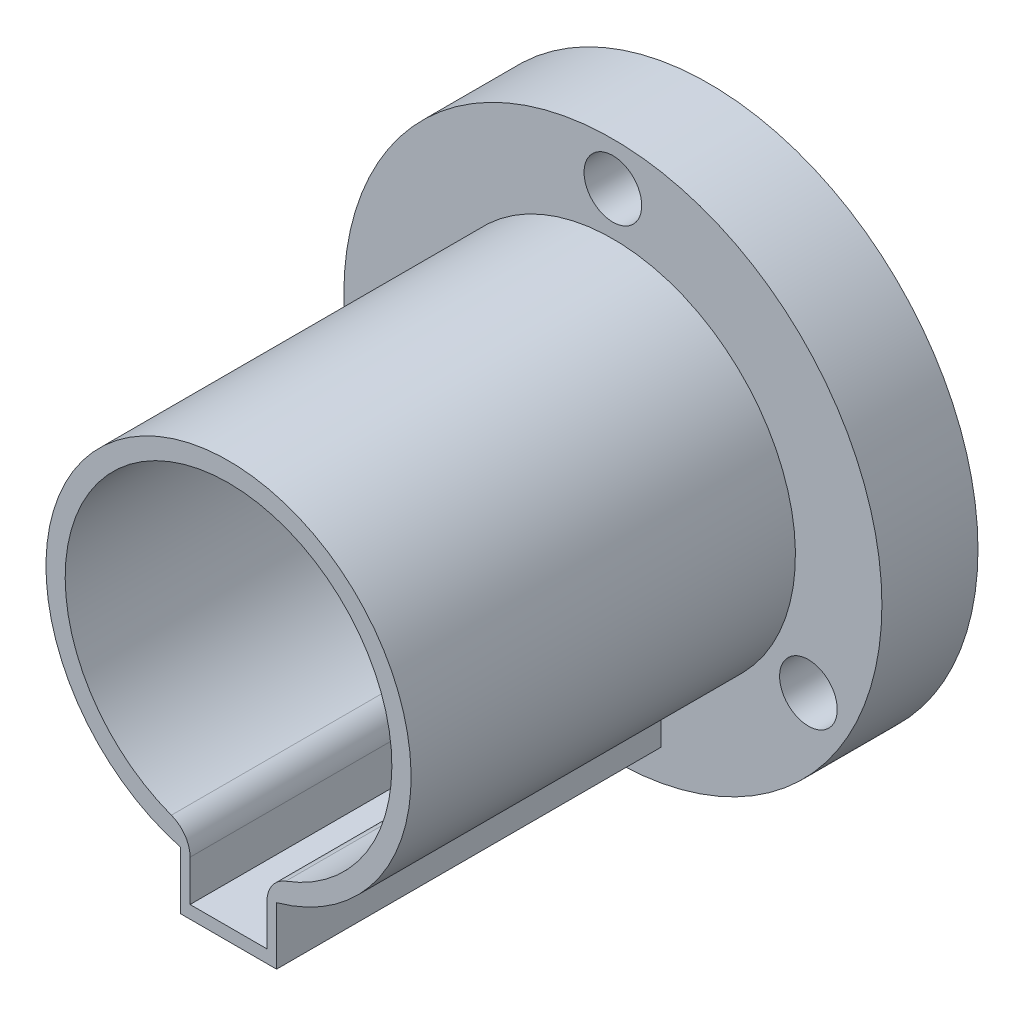
ISO-10303-21;
HEADER;
FILE_DESCRIPTION(('STEP AP214'),'2;1');
FILE_NAME('part.step','',(''),(''),'','','');
FILE_SCHEMA(('AUTOMOTIVE_DESIGN { 1 0 10303 214 1 1 1 1 }'));
ENDSEC;
DATA;
#1=APPLICATION_CONTEXT('core data for automotive mechanical design processes');
#2=APPLICATION_PROTOCOL_DEFINITION('international standard','automotive_design',2000,#1);
#3=PRODUCT_CONTEXT('',#1,'mechanical');
#4=PRODUCT('Part','Part','',(#3));
#5=PRODUCT_RELATED_PRODUCT_CATEGORY('part','',(#4));
#6=PRODUCT_DEFINITION_FORMATION('','',#4);
#7=PRODUCT_DEFINITION_CONTEXT('part definition',#1,'design');
#8=PRODUCT_DEFINITION('design','',#6,#7);
#9=PRODUCT_DEFINITION_SHAPE('','',#8);
#10=(LENGTH_UNIT() NAMED_UNIT(*) SI_UNIT(.MILLI.,.METRE.));
#11=(NAMED_UNIT(*) PLANE_ANGLE_UNIT() SI_UNIT($,.RADIAN.));
#12=(NAMED_UNIT(*) SI_UNIT($,.STERADIAN.) SOLID_ANGLE_UNIT());
#13=UNCERTAINTY_MEASURE_WITH_UNIT(LENGTH_MEASURE(1.E-05),#10,'distance_accuracy_value','');
#14=(GEOMETRIC_REPRESENTATION_CONTEXT(3) GLOBAL_UNCERTAINTY_ASSIGNED_CONTEXT((#13)) GLOBAL_UNIT_ASSIGNED_CONTEXT((#10,
#11,#12)) REPRESENTATION_CONTEXT('',''));
#15=CARTESIAN_POINT('',(0.,0.,0.));
#16=DIRECTION('',(0.,0.,1.));
#17=DIRECTION('',(1.,0.,0.));
#18=AXIS2_PLACEMENT_3D('',#15,#16,#17);
#19=CARTESIAN_POINT('',(0.,0.,5.));
#20=DIRECTION('',(0.,0.,1.));
#21=DIRECTION('',(1.,0.,0.));
#22=AXIS2_PLACEMENT_3D('',#19,#20,#21);
#23=PLANE('',#22);
#24=CARTESIAN_POINT('',(10.1757984944672,-5.87499999999991,5.));
#25=DIRECTION('',(0.,0.,1.));
#26=DIRECTION('',(-0.499999999999992,-0.866025403784443,0.));
#27=AXIS2_PLACEMENT_3D('',#24,#25,#26);
#28=CIRCLE('',#27,1.5);
#29=CARTESIAN_POINT('',(9.42579849446722,-7.17403810567657,5.));
#30=VERTEX_POINT('',#29);
#31=EDGE_CURVE('E258',#30,#30,#28,.T.);
#32=ORIENTED_EDGE('',*,*,#31,.F.);
#33=EDGE_LOOP('',(#32));
#34=FACE_BOUND('',#33,.T.);
#35=CARTESIAN_POINT('',(-10.1757984944671,-5.87500000000005,5.));
#36=DIRECTION('',(0.,0.,1.));
#37=DIRECTION('',(-0.500000000000004,0.866025403784436,0.));
#38=AXIS2_PLACEMENT_3D('',#35,#36,#37);
#39=CIRCLE('',#38,1.5);
#40=CARTESIAN_POINT('',(-10.9257984944671,-4.57596189432339,5.));
#41=VERTEX_POINT('',#40);
#42=EDGE_CURVE('E254',#41,#41,#39,.T.);
#43=ORIENTED_EDGE('',*,*,#42,.F.);
#44=EDGE_LOOP('',(#43));
#45=FACE_BOUND('',#44,.T.);
#46=CARTESIAN_POINT('',(0.,11.75,5.));
#47=DIRECTION('',(0.,0.,1.));
#48=DIRECTION('',(1.,0.,0.));
#49=AXIS2_PLACEMENT_3D('',#46,#47,#48);
#50=CIRCLE('',#49,1.5);
#51=CARTESIAN_POINT('',(1.5,11.75,5.));
#52=VERTEX_POINT('',#51);
#53=EDGE_CURVE('E250',#52,#52,#50,.T.);
#54=ORIENTED_EDGE('',*,*,#53,.F.);
#55=EDGE_LOOP('',(#54));
#56=FACE_BOUND('',#55,.T.);
#57=CARTESIAN_POINT('',(0.,0.,5.));
#58=DIRECTION('',(0.,0.,1.));
#59=DIRECTION('',(1.,0.,0.));
#60=AXIS2_PLACEMENT_3D('',#57,#58,#59);
#61=CIRCLE('',#60,14.);
#62=CARTESIAN_POINT('',(14.,0.,5.));
#63=VERTEX_POINT('',#62);
#64=EDGE_CURVE('E176',#63,#63,#61,.T.);
#65=ORIENTED_EDGE('',*,*,#64,.T.);
#66=EDGE_LOOP('',(#65));
#67=FACE_BOUND('',#66,.T.);
#68=DIRECTION('',(0.,-1.,0.));
#69=VECTOR('',#68,1.);
#70=CARTESIAN_POINT('',(-2.5,-9.16515138991168,5.));
#71=LINE('',#70,#69);
#72=CARTESIAN_POINT('',(-2.5,-9.16515138991168,5.));
#73=VERTEX_POINT('',#72);
#74=CARTESIAN_POINT('',(-2.5,-12.1651513899117,5.));
#75=VERTEX_POINT('',#74);
#76=EDGE_CURVE('E160',#73,#75,#71,.T.);
#77=ORIENTED_EDGE('',*,*,#76,.F.);
#78=CARTESIAN_POINT('',(0.,0.,5.));
#79=DIRECTION('',(0.,0.,1.));
#80=DIRECTION('',(1.,0.,0.));
#81=AXIS2_PLACEMENT_3D('',#78,#79,#80);
#82=CIRCLE('',#81,9.5);
#83=CARTESIAN_POINT('',(2.5,-9.16515138991168,5.));
#84=VERTEX_POINT('',#83);
#85=EDGE_CURVE('E144',#84,#73,#82,.T.);
#86=ORIENTED_EDGE('',*,*,#85,.F.);
#87=DIRECTION('',(0.,1.,0.));
#88=VECTOR('',#87,1.);
#89=CARTESIAN_POINT('',(2.5,-9.16515138991168,5.));
#90=LINE('',#89,#88);
#91=CARTESIAN_POINT('',(2.5,-12.1651513899117,5.));
#92=VERTEX_POINT('',#91);
#93=EDGE_CURVE('E151',#92,#84,#90,.T.);
#94=ORIENTED_EDGE('',*,*,#93,.F.);
#95=DIRECTION('',(1.,0.,0.));
#96=VECTOR('',#95,1.);
#97=CARTESIAN_POINT('',(2.5,-12.1651513899117,5.));
#98=LINE('',#97,#96);
#99=EDGE_CURVE('E162',#75,#92,#98,.T.);
#100=ORIENTED_EDGE('',*,*,#99,.F.);
#101=EDGE_LOOP('',(#77,#86,#94,#100));
#102=FACE_BOUND('',#101,.T.);
#103=ADVANCED_FACE('F33',(#34,#45,#56,#67,#102),#23,.T.);
#104=CARTESIAN_POINT('',(0.,0.,5.));
#105=DIRECTION('',(0.,0.,-1.));
#106=DIRECTION('',(-1.,0.,0.));
#107=AXIS2_PLACEMENT_3D('',#104,#105,#106);
#108=CYLINDRICAL_SURFACE('',#107,14.);
#109=ORIENTED_EDGE('',*,*,#64,.F.);
#110=EDGE_LOOP('',(#109));
#111=FACE_BOUND('',#110,.T.);
#112=CARTESIAN_POINT('',(0.,0.,0.));
#113=DIRECTION('',(0.,0.,1.));
#114=DIRECTION('',(1.,0.,0.));
#115=AXIS2_PLACEMENT_3D('',#112,#113,#114);
#116=CIRCLE('',#115,14.);
#117=CARTESIAN_POINT('',(14.,0.,0.));
#118=VERTEX_POINT('',#117);
#119=EDGE_CURVE('E175',#118,#118,#116,.T.);
#120=ORIENTED_EDGE('',*,*,#119,.T.);
#121=EDGE_LOOP('',(#120));
#122=FACE_BOUND('',#121,.T.);
#123=ADVANCED_FACE('F214',(#111,#122),#108,.T.);
#124=CARTESIAN_POINT('',(0.,0.,0.));
#125=DIRECTION('',(0.,0.,1.));
#126=DIRECTION('',(1.,0.,0.));
#127=AXIS2_PLACEMENT_3D('',#124,#125,#126);
#128=PLANE('',#127);
#129=CARTESIAN_POINT('',(10.1757984944672,-5.87499999999991,0.));
#130=DIRECTION('',(0.,0.,1.));
#131=DIRECTION('',(-0.499999999999992,-0.866025403784443,0.));
#132=AXIS2_PLACEMENT_3D('',#129,#130,#131);
#133=CIRCLE('',#132,1.5);
#134=CARTESIAN_POINT('',(9.42579849446722,-7.17403810567657,0.));
#135=VERTEX_POINT('',#134);
#136=EDGE_CURVE('E242',#135,#135,#133,.T.);
#137=ORIENTED_EDGE('',*,*,#136,.T.);
#138=EDGE_LOOP('',(#137));
#139=FACE_BOUND('',#138,.T.);
#140=CARTESIAN_POINT('',(-10.1757984944671,-5.87500000000005,0.));
#141=DIRECTION('',(0.,0.,1.));
#142=DIRECTION('',(-0.500000000000004,0.866025403784436,0.));
#143=AXIS2_PLACEMENT_3D('',#140,#141,#142);
#144=CIRCLE('',#143,1.5);
#145=CARTESIAN_POINT('',(-10.9257984944671,-4.57596189432339,0.));
#146=VERTEX_POINT('',#145);
#147=EDGE_CURVE('E246',#146,#146,#144,.T.);
#148=ORIENTED_EDGE('',*,*,#147,.T.);
#149=EDGE_LOOP('',(#148));
#150=FACE_BOUND('',#149,.T.);
#151=CARTESIAN_POINT('',(0.,11.75,0.));
#152=DIRECTION('',(0.,0.,1.));
#153=DIRECTION('',(1.,0.,0.));
#154=AXIS2_PLACEMENT_3D('',#151,#152,#153);
#155=CIRCLE('',#154,1.5);
#156=CARTESIAN_POINT('',(1.5,11.75,0.));
#157=VERTEX_POINT('',#156);
#158=EDGE_CURVE('E137',#157,#157,#155,.T.);
#159=ORIENTED_EDGE('',*,*,#158,.T.);
#160=EDGE_LOOP('',(#159));
#161=FACE_BOUND('',#160,.T.);
#162=DIRECTION('',(0.,1.,0.));
#163=VECTOR('',#162,1.);
#164=CARTESIAN_POINT('',(2.,0.,0.));
#165=LINE('',#164,#163);
#166=CARTESIAN_POINT('',(2.,-11.5,0.));
#167=VERTEX_POINT('',#166);
#168=CARTESIAN_POINT('',(2.,-9.3674969975976,0.));
#169=VERTEX_POINT('',#168);
#170=EDGE_CURVE('E128',#167,#169,#165,.T.);
#171=ORIENTED_EDGE('',*,*,#170,.T.);
#172=CARTESIAN_POINT('',(3.5,-9.3674969975976,0.));
#173=DIRECTION('',(0.,0.,1.));
#174=DIRECTION('',(1.,0.,0.));
#175=AXIS2_PLACEMENT_3D('',#172,#173,#174);
#176=CIRCLE('',#175,1.5);
#177=CARTESIAN_POINT('',(2.975,-7.96237244795796,0.));
#178=VERTEX_POINT('',#177);
#179=EDGE_CURVE('E41',#169,#178,#176,.F.);
#180=ORIENTED_EDGE('',*,*,#179,.T.);
#181=CARTESIAN_POINT('',(0.,0.,0.));
#182=DIRECTION('',(0.,0.,1.));
#183=DIRECTION('',(1.,0.,0.));
#184=AXIS2_PLACEMENT_3D('',#181,#182,#183);
#185=CIRCLE('',#184,8.5);
#186=CARTESIAN_POINT('',(-2.975,-7.96237244795796,0.));
#187=VERTEX_POINT('',#186);
#188=EDGE_CURVE('E142',#178,#187,#185,.T.);
#189=ORIENTED_EDGE('',*,*,#188,.T.);
#190=CARTESIAN_POINT('',(-3.5,-9.3674969975976,0.));
#191=DIRECTION('',(0.,0.,1.));
#192=DIRECTION('',(1.,0.,0.));
#193=AXIS2_PLACEMENT_3D('',#190,#191,#192);
#194=CIRCLE('',#193,1.5);
#195=CARTESIAN_POINT('',(-2.,-9.3674969975976,0.));
#196=VERTEX_POINT('',#195);
#197=EDGE_CURVE('E48',#187,#196,#194,.F.);
#198=ORIENTED_EDGE('',*,*,#197,.T.);
#199=DIRECTION('',(0.,-1.,0.));
#200=VECTOR('',#199,1.);
#201=CARTESIAN_POINT('',(-2.,0.,0.));
#202=LINE('',#201,#200);
#203=CARTESIAN_POINT('',(-2.,-11.5,0.));
#204=VERTEX_POINT('',#203);
#205=EDGE_CURVE('E109',#196,#204,#202,.T.);
#206=ORIENTED_EDGE('',*,*,#205,.T.);
#207=DIRECTION('',(1.,0.,0.));
#208=VECTOR('',#207,1.);
#209=CARTESIAN_POINT('',(-2.,-11.5,0.));
#210=LINE('',#209,#208);
#211=EDGE_CURVE('E114',#204,#167,#210,.T.);
#212=ORIENTED_EDGE('',*,*,#211,.T.);
#213=EDGE_LOOP('',(#171,#180,#189,#198,#206,#212));
#214=FACE_BOUND('',#213,.T.);
#215=ORIENTED_EDGE('',*,*,#119,.F.);
#216=EDGE_LOOP('',(#215));
#217=FACE_BOUND('',#216,.T.);
#218=ADVANCED_FACE('F111',(#139,#150,#161,#214,#217),#128,.F.);
#219=CARTESIAN_POINT('',(0.,0.,25.));
#220=DIRECTION('',(0.,0.,-1.));
#221=DIRECTION('',(-1.,0.,0.));
#222=AXIS2_PLACEMENT_3D('',#219,#220,#221);
#223=CYLINDRICAL_SURFACE('',#222,9.5);
#224=ORIENTED_EDGE('',*,*,#85,.T.);
#225=DIRECTION('',(0.,0.,-1.));
#226=VECTOR('',#225,1.);
#227=CARTESIAN_POINT('',(-2.5,-9.16515138991168,25.));
#228=LINE('',#227,#226);
#229=CARTESIAN_POINT('',(-2.5,-9.16515138991168,25.));
#230=VERTEX_POINT('',#229);
#231=EDGE_CURVE('E173',#230,#73,#228,.T.);
#232=ORIENTED_EDGE('',*,*,#231,.F.);
#233=CARTESIAN_POINT('',(0.,0.,25.));
#234=DIRECTION('',(0.,0.,1.));
#235=DIRECTION('',(1.,0.,0.));
#236=AXIS2_PLACEMENT_3D('',#233,#234,#235);
#237=CIRCLE('',#236,9.5);
#238=CARTESIAN_POINT('',(2.5,-9.16515138991168,25.));
#239=VERTEX_POINT('',#238);
#240=EDGE_CURVE('E147',#239,#230,#237,.T.);
#241=ORIENTED_EDGE('',*,*,#240,.F.);
#242=DIRECTION('',(0.,0.,-1.));
#243=VECTOR('',#242,1.);
#244=CARTESIAN_POINT('',(2.5,-9.16515138991168,25.));
#245=LINE('',#244,#243);
#246=EDGE_CURVE('E157',#239,#84,#245,.T.);
#247=ORIENTED_EDGE('',*,*,#246,.T.);
#248=EDGE_LOOP('',(#224,#232,#241,#247));
#249=FACE_BOUND('',#248,.T.);
#250=ADVANCED_FACE('F228',(#249),#223,.T.);
#251=CARTESIAN_POINT('',(-2.5,-9.16515138991168,25.));
#252=DIRECTION('',(1.,0.,0.));
#253=DIRECTION('',(0.,1.,0.));
#254=AXIS2_PLACEMENT_3D('',#251,#252,#253);
#255=PLANE('',#254);
#256=ORIENTED_EDGE('',*,*,#76,.T.);
#257=DIRECTION('',(0.,0.,-1.));
#258=VECTOR('',#257,1.);
#259=CARTESIAN_POINT('',(-2.5,-12.1651513899117,25.));
#260=LINE('',#259,#258);
#261=CARTESIAN_POINT('',(-2.5,-12.1651513899117,25.));
#262=VERTEX_POINT('',#261);
#263=EDGE_CURVE('E170',#262,#75,#260,.T.);
#264=ORIENTED_EDGE('',*,*,#263,.F.);
#265=DIRECTION('',(0.,-1.,0.));
#266=VECTOR('',#265,1.);
#267=CARTESIAN_POINT('',(-2.5,-9.16515138991168,25.));
#268=LINE('',#267,#266);
#269=EDGE_CURVE('E150',#230,#262,#268,.T.);
#270=ORIENTED_EDGE('',*,*,#269,.F.);
#271=ORIENTED_EDGE('',*,*,#231,.T.);
#272=EDGE_LOOP('',(#256,#264,#270,#271));
#273=FACE_BOUND('',#272,.T.);
#274=ADVANCED_FACE('F237',(#273),#255,.F.);
#275=CARTESIAN_POINT('',(2.5,-12.1651513899117,25.));
#276=DIRECTION('',(0.,1.,0.));
#277=DIRECTION('',(-1.,0.,0.));
#278=AXIS2_PLACEMENT_3D('',#275,#276,#277);
#279=PLANE('',#278);
#280=ORIENTED_EDGE('',*,*,#99,.T.);
#281=DIRECTION('',(0.,0.,-1.));
#282=VECTOR('',#281,1.);
#283=CARTESIAN_POINT('',(2.5,-12.1651513899117,25.));
#284=LINE('',#283,#282);
#285=CARTESIAN_POINT('',(2.5,-12.1651513899117,25.));
#286=VERTEX_POINT('',#285);
#287=EDGE_CURVE('E168',#286,#92,#284,.T.);
#288=ORIENTED_EDGE('',*,*,#287,.F.);
#289=DIRECTION('',(1.,0.,0.));
#290=VECTOR('',#289,1.);
#291=CARTESIAN_POINT('',(2.5,-12.1651513899117,25.));
#292=LINE('',#291,#290);
#293=EDGE_CURVE('E153',#262,#286,#292,.T.);
#294=ORIENTED_EDGE('',*,*,#293,.F.);
#295=ORIENTED_EDGE('',*,*,#263,.T.);
#296=EDGE_LOOP('',(#280,#288,#294,#295));
#297=FACE_BOUND('',#296,.T.);
#298=ADVANCED_FACE('F286',(#297),#279,.F.);
#299=CARTESIAN_POINT('',(2.5,-9.16515138991168,25.));
#300=DIRECTION('',(-1.,0.,0.));
#301=DIRECTION('',(0.,-1.,0.));
#302=AXIS2_PLACEMENT_3D('',#299,#300,#301);
#303=PLANE('',#302);
#304=ORIENTED_EDGE('',*,*,#93,.T.);
#305=ORIENTED_EDGE('',*,*,#246,.F.);
#306=DIRECTION('',(0.,1.,0.));
#307=VECTOR('',#306,1.);
#308=CARTESIAN_POINT('',(2.5,-9.16515138991168,25.));
#309=LINE('',#308,#307);
#310=EDGE_CURVE('E155',#286,#239,#309,.T.);
#311=ORIENTED_EDGE('',*,*,#310,.F.);
#312=ORIENTED_EDGE('',*,*,#287,.T.);
#313=EDGE_LOOP('',(#304,#305,#311,#312));
#314=FACE_BOUND('',#313,.T.);
#315=ADVANCED_FACE('F283',(#314),#303,.F.);
#316=CARTESIAN_POINT('',(0.,0.,25.));
#317=DIRECTION('',(0.,0.,1.));
#318=DIRECTION('',(1.,0.,0.));
#319=AXIS2_PLACEMENT_3D('',#316,#317,#318);
#320=PLANE('',#319);
#321=CARTESIAN_POINT('',(0.,0.,25.));
#322=DIRECTION('',(0.,0.,1.));
#323=DIRECTION('',(1.,0.,0.));
#324=AXIS2_PLACEMENT_3D('',#321,#322,#323);
#325=CIRCLE('',#324,8.5);
#326=CARTESIAN_POINT('',(2.975,-7.96237244795796,25.));
#327=VERTEX_POINT('',#326);
#328=CARTESIAN_POINT('',(-2.975,-7.96237244795796,25.));
#329=VERTEX_POINT('',#328);
#330=EDGE_CURVE('E140',#327,#329,#325,.T.);
#331=ORIENTED_EDGE('',*,*,#330,.F.);
#332=CARTESIAN_POINT('',(3.5,-9.3674969975976,25.));
#333=DIRECTION('',(0.,0.,1.));
#334=DIRECTION('',(1.,0.,0.));
#335=AXIS2_PLACEMENT_3D('',#332,#333,#334);
#336=CIRCLE('',#335,1.5);
#337=CARTESIAN_POINT('',(2.,-9.3674969975976,25.));
#338=VERTEX_POINT('',#337);
#339=EDGE_CURVE('E189',#327,#338,#336,.T.);
#340=ORIENTED_EDGE('',*,*,#339,.T.);
#341=DIRECTION('',(0.,1.,0.));
#342=VECTOR('',#341,1.);
#343=CARTESIAN_POINT('',(2.,0.,25.));
#344=LINE('',#343,#342);
#345=CARTESIAN_POINT('',(2.,-11.5,25.));
#346=VERTEX_POINT('',#345);
#347=EDGE_CURVE('E117',#346,#338,#344,.T.);
#348=ORIENTED_EDGE('',*,*,#347,.F.);
#349=DIRECTION('',(1.,0.,0.));
#350=VECTOR('',#349,1.);
#351=CARTESIAN_POINT('',(-2.,-11.5,25.));
#352=LINE('',#351,#350);
#353=CARTESIAN_POINT('',(-2.,-11.5,25.));
#354=VERTEX_POINT('',#353);
#355=EDGE_CURVE('E136',#354,#346,#352,.T.);
#356=ORIENTED_EDGE('',*,*,#355,.F.);
#357=DIRECTION('',(0.,-1.,0.));
#358=VECTOR('',#357,1.);
#359=CARTESIAN_POINT('',(-2.,0.,25.));
#360=LINE('',#359,#358);
#361=CARTESIAN_POINT('',(-2.,-9.3674969975976,25.));
#362=VERTEX_POINT('',#361);
#363=EDGE_CURVE('E123',#362,#354,#360,.T.);
#364=ORIENTED_EDGE('',*,*,#363,.F.);
#365=CARTESIAN_POINT('',(-3.5,-9.3674969975976,25.));
#366=DIRECTION('',(0.,0.,1.));
#367=DIRECTION('',(1.,0.,0.));
#368=AXIS2_PLACEMENT_3D('',#365,#366,#367);
#369=CIRCLE('',#368,1.5);
#370=EDGE_CURVE('E187',#362,#329,#369,.T.);
#371=ORIENTED_EDGE('',*,*,#370,.T.);
#372=EDGE_LOOP('',(#331,#340,#348,#356,#364,#371));
#373=FACE_BOUND('',#372,.T.);
#374=ORIENTED_EDGE('',*,*,#240,.T.);
#375=ORIENTED_EDGE('',*,*,#269,.T.);
#376=ORIENTED_EDGE('',*,*,#293,.T.);
#377=ORIENTED_EDGE('',*,*,#310,.T.);
#378=EDGE_LOOP('',(#374,#375,#376,#377));
#379=FACE_BOUND('',#378,.T.);
#380=ADVANCED_FACE('F203',(#373,#379),#320,.T.);
#381=CARTESIAN_POINT('',(0.,0.,0.));
#382=DIRECTION('',(0.,0.,1.));
#383=DIRECTION('',(1.,0.,0.));
#384=AXIS2_PLACEMENT_3D('',#381,#382,#383);
#385=CYLINDRICAL_SURFACE('',#384,8.5);
#386=ORIENTED_EDGE('',*,*,#188,.F.);
#387=DIRECTION('',(0.,0.,1.));
#388=VECTOR('',#387,1.);
#389=CARTESIAN_POINT('',(2.975,-7.96237244795796,0.));
#390=LINE('',#389,#388);
#391=EDGE_CURVE('E184',#178,#327,#390,.T.);
#392=ORIENTED_EDGE('',*,*,#391,.T.);
#393=ORIENTED_EDGE('',*,*,#330,.T.);
#394=DIRECTION('',(0.,0.,1.));
#395=VECTOR('',#394,1.);
#396=CARTESIAN_POINT('',(-2.975,-7.96237244795796,0.));
#397=LINE('',#396,#395);
#398=EDGE_CURVE('E179',#329,#187,#397,.F.);
#399=ORIENTED_EDGE('',*,*,#398,.T.);
#400=EDGE_LOOP('',(#386,#392,#393,#399));
#401=FACE_BOUND('',#400,.T.);
#402=ADVANCED_FACE('F197',(#401),#385,.F.);
#403=CARTESIAN_POINT('',(-2.,0.,0.));
#404=DIRECTION('',(-1.,0.,0.));
#405=DIRECTION('',(0.,-1.,0.));
#406=AXIS2_PLACEMENT_3D('',#403,#404,#405);
#407=PLANE('',#406);
#408=ORIENTED_EDGE('',*,*,#205,.F.);
#409=DIRECTION('',(0.,0.,1.));
#410=VECTOR('',#409,1.);
#411=CARTESIAN_POINT('',(-2.,-9.3674969975976,0.));
#412=LINE('',#411,#410);
#413=EDGE_CURVE('E11',#196,#362,#412,.T.);
#414=ORIENTED_EDGE('',*,*,#413,.T.);
#415=ORIENTED_EDGE('',*,*,#363,.T.);
#416=DIRECTION('',(0.,0.,1.));
#417=VECTOR('',#416,1.);
#418=CARTESIAN_POINT('',(-2.,-11.5,0.));
#419=LINE('',#418,#417);
#420=EDGE_CURVE('E120',#204,#354,#419,.T.);
#421=ORIENTED_EDGE('',*,*,#420,.F.);
#422=EDGE_LOOP('',(#408,#414,#415,#421));
#423=FACE_BOUND('',#422,.T.);
#424=ADVANCED_FACE('F121',(#423),#407,.F.);
#425=CARTESIAN_POINT('',(2.,0.,0.));
#426=DIRECTION('',(1.,0.,0.));
#427=DIRECTION('',(0.,1.,0.));
#428=AXIS2_PLACEMENT_3D('',#425,#426,#427);
#429=PLANE('',#428);
#430=ORIENTED_EDGE('',*,*,#347,.T.);
#431=DIRECTION('',(0.,0.,1.));
#432=VECTOR('',#431,1.);
#433=CARTESIAN_POINT('',(2.,-9.3674969975976,0.));
#434=LINE('',#433,#432);
#435=EDGE_CURVE('E56',#338,#169,#434,.F.);
#436=ORIENTED_EDGE('',*,*,#435,.T.);
#437=ORIENTED_EDGE('',*,*,#170,.F.);
#438=DIRECTION('',(0.,0.,1.));
#439=VECTOR('',#438,1.);
#440=CARTESIAN_POINT('',(2.,-11.5,0.));
#441=LINE('',#440,#439);
#442=EDGE_CURVE('E127',#167,#346,#441,.T.);
#443=ORIENTED_EDGE('',*,*,#442,.T.);
#444=EDGE_LOOP('',(#430,#436,#437,#443));
#445=FACE_BOUND('',#444,.T.);
#446=ADVANCED_FACE('F205',(#445),#429,.F.);
#447=CARTESIAN_POINT('',(-2.,-11.5,0.));
#448=DIRECTION('',(0.,-1.,0.));
#449=DIRECTION('',(0.,0.,-1.));
#450=AXIS2_PLACEMENT_3D('',#447,#448,#449);
#451=PLANE('',#450);
#452=ORIENTED_EDGE('',*,*,#355,.T.);
#453=ORIENTED_EDGE('',*,*,#442,.F.);
#454=ORIENTED_EDGE('',*,*,#211,.F.);
#455=ORIENTED_EDGE('',*,*,#420,.T.);
#456=EDGE_LOOP('',(#452,#453,#454,#455));
#457=FACE_BOUND('',#456,.T.);
#458=ADVANCED_FACE('F130',(#457),#451,.F.);
#459=CARTESIAN_POINT('',(0.,11.75,0.));
#460=DIRECTION('',(0.,0.,1.));
#461=DIRECTION('',(1.,0.,0.));
#462=AXIS2_PLACEMENT_3D('',#459,#460,#461);
#463=CYLINDRICAL_SURFACE('',#462,1.5);
#464=ORIENTED_EDGE('',*,*,#158,.F.);
#465=EDGE_LOOP('',(#464));
#466=FACE_BOUND('',#465,.T.);
#467=ORIENTED_EDGE('',*,*,#53,.T.);
#468=EDGE_LOOP('',(#467));
#469=FACE_BOUND('',#468,.T.);
#470=ADVANCED_FACE('F268',(#466,#469),#463,.F.);
#471=CARTESIAN_POINT('',(-10.1757984944671,-5.87500000000005,0.));
#472=DIRECTION('',(0.,0.,1.));
#473=DIRECTION('',(1.,0.,0.));
#474=AXIS2_PLACEMENT_3D('',#471,#472,#473);
#475=CYLINDRICAL_SURFACE('',#474,1.5);
#476=ORIENTED_EDGE('',*,*,#147,.F.);
#477=EDGE_LOOP('',(#476));
#478=FACE_BOUND('',#477,.T.);
#479=ORIENTED_EDGE('',*,*,#42,.T.);
#480=EDGE_LOOP('',(#479));
#481=FACE_BOUND('',#480,.T.);
#482=ADVANCED_FACE('F263',(#478,#481),#475,.F.);
#483=CARTESIAN_POINT('',(10.1757984944672,-5.87499999999991,0.));
#484=DIRECTION('',(0.,0.,1.));
#485=DIRECTION('',(1.,0.,0.));
#486=AXIS2_PLACEMENT_3D('',#483,#484,#485);
#487=CYLINDRICAL_SURFACE('',#486,1.5);
#488=ORIENTED_EDGE('',*,*,#136,.F.);
#489=EDGE_LOOP('',(#488));
#490=FACE_BOUND('',#489,.T.);
#491=ORIENTED_EDGE('',*,*,#31,.T.);
#492=EDGE_LOOP('',(#491));
#493=FACE_BOUND('',#492,.T.);
#494=ADVANCED_FACE('F212',(#490,#493),#487,.F.);
#495=CARTESIAN_POINT('',(3.5,-9.3674969975976,0.));
#496=DIRECTION('',(0.,0.,1.));
#497=DIRECTION('',(1.,0.,0.));
#498=AXIS2_PLACEMENT_3D('',#495,#496,#497);
#499=CYLINDRICAL_SURFACE('',#498,1.5);
#500=ORIENTED_EDGE('',*,*,#179,.F.);
#501=ORIENTED_EDGE('',*,*,#435,.F.);
#502=ORIENTED_EDGE('',*,*,#339,.F.);
#503=ORIENTED_EDGE('',*,*,#391,.F.);
#504=EDGE_LOOP('',(#500,#501,#502,#503));
#505=FACE_BOUND('',#504,.T.);
#506=ADVANCED_FACE('F200',(#505),#499,.T.);
#507=CARTESIAN_POINT('',(-3.5,-9.3674969975976,0.));
#508=DIRECTION('',(0.,0.,1.));
#509=DIRECTION('',(1.,0.,0.));
#510=AXIS2_PLACEMENT_3D('',#507,#508,#509);
#511=CYLINDRICAL_SURFACE('',#510,1.5);
#512=ORIENTED_EDGE('',*,*,#370,.F.);
#513=ORIENTED_EDGE('',*,*,#413,.F.);
#514=ORIENTED_EDGE('',*,*,#197,.F.);
#515=ORIENTED_EDGE('',*,*,#398,.F.);
#516=EDGE_LOOP('',(#512,#513,#514,#515));
#517=FACE_BOUND('',#516,.T.);
#518=ADVANCED_FACE('F35',(#517),#511,.T.);
#519=CLOSED_SHELL('',(#103,#123,#218,#250,#274,#298,#315,#380,#402,#424,#446,#458,#470,#482,
#494,#506,#518));
#520=MANIFOLD_SOLID_BREP('B2',#519);
#521=ADVANCED_BREP_SHAPE_REPRESENTATION('',(#18,#520),#14);
#522=SHAPE_DEFINITION_REPRESENTATION(#9,#521);
ENDSEC;
END-ISO-10303-21;
